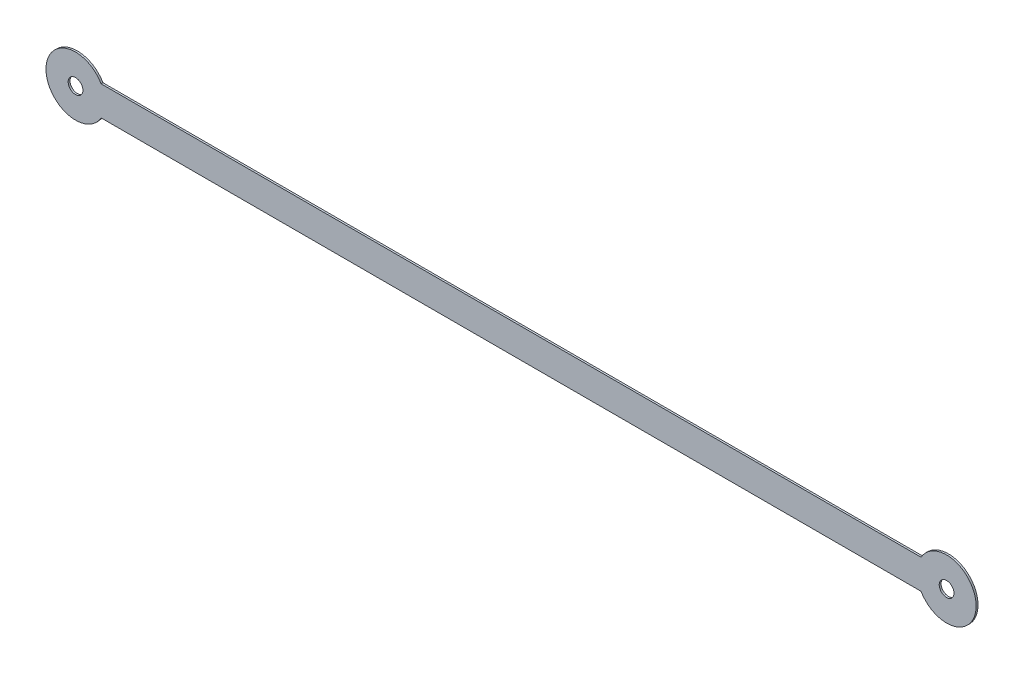
ISO-10303-21;
HEADER;
FILE_DESCRIPTION(('STEP AP214'),'2;1');
FILE_NAME('part.step','',(''),(''),'','','');
FILE_SCHEMA(('AUTOMOTIVE_DESIGN { 1 0 10303 214 1 1 1 1 }'));
ENDSEC;
DATA;
#1=APPLICATION_CONTEXT('core data for automotive mechanical design processes');
#2=APPLICATION_PROTOCOL_DEFINITION('international standard','automotive_design',2000,#1);
#3=PRODUCT_CONTEXT('',#1,'mechanical');
#4=PRODUCT('Part','Part','',(#3));
#5=PRODUCT_RELATED_PRODUCT_CATEGORY('part','',(#4));
#6=PRODUCT_DEFINITION_FORMATION('','',#4);
#7=PRODUCT_DEFINITION_CONTEXT('part definition',#1,'design');
#8=PRODUCT_DEFINITION('design','',#6,#7);
#9=PRODUCT_DEFINITION_SHAPE('','',#8);
#10=(LENGTH_UNIT() NAMED_UNIT(*) SI_UNIT(.MILLI.,.METRE.));
#11=(NAMED_UNIT(*) PLANE_ANGLE_UNIT() SI_UNIT($,.RADIAN.));
#12=(NAMED_UNIT(*) SI_UNIT($,.STERADIAN.) SOLID_ANGLE_UNIT());
#13=UNCERTAINTY_MEASURE_WITH_UNIT(LENGTH_MEASURE(1.E-05),#10,'distance_accuracy_value','');
#14=(GEOMETRIC_REPRESENTATION_CONTEXT(3) GLOBAL_UNCERTAINTY_ASSIGNED_CONTEXT((#13)) GLOBAL_UNIT_ASSIGNED_CONTEXT((#10,
#11,#12)) REPRESENTATION_CONTEXT('',''));
#15=CARTESIAN_POINT('',(0.,0.,0.));
#16=DIRECTION('',(0.,0.,1.));
#17=DIRECTION('',(1.,0.,0.));
#18=AXIS2_PLACEMENT_3D('',#15,#16,#17);
#19=CARTESIAN_POINT('',(0.,0.,0.254));
#20=DIRECTION('',(0.,0.,1.));
#21=DIRECTION('',(1.,0.,0.));
#22=AXIS2_PLACEMENT_3D('',#19,#20,#21);
#23=PLANE('',#22);
#24=DIRECTION('',(1.,0.,0.));
#25=VECTOR('',#24,1.);
#26=CARTESIAN_POINT('',(114.535898384862,-2.,0.254));
#27=LINE('',#26,#25);
#28=CARTESIAN_POINT('',(3.46410161513775,-2.,0.254));
#29=VERTEX_POINT('',#28);
#30=CARTESIAN_POINT('',(114.535898384862,-2.,0.254));
#31=VERTEX_POINT('',#30);
#32=EDGE_CURVE('E91',#29,#31,#27,.T.);
#33=ORIENTED_EDGE('',*,*,#32,.T.);
#34=CARTESIAN_POINT('',(118.,0.,0.254));
#35=DIRECTION('',(0.,0.,1.));
#36=DIRECTION('',(1.,0.,0.));
#37=AXIS2_PLACEMENT_3D('',#34,#35,#36);
#38=CIRCLE('',#37,4.);
#39=CARTESIAN_POINT('',(114.535898384862,2.,0.254));
#40=VERTEX_POINT('',#39);
#41=EDGE_CURVE('E11',#31,#40,#38,.T.);
#42=ORIENTED_EDGE('',*,*,#41,.T.);
#43=DIRECTION('',(-1.,0.,0.));
#44=VECTOR('',#43,1.);
#45=CARTESIAN_POINT('',(114.535898384862,2.,0.254));
#46=LINE('',#45,#44);
#47=CARTESIAN_POINT('',(3.46410161513775,2.,0.254));
#48=VERTEX_POINT('',#47);
#49=EDGE_CURVE('E96',#40,#48,#46,.T.);
#50=ORIENTED_EDGE('',*,*,#49,.T.);
#51=CARTESIAN_POINT('',(0.,0.,0.254));
#52=DIRECTION('',(0.,0.,1.));
#53=DIRECTION('',(1.,0.,0.));
#54=AXIS2_PLACEMENT_3D('',#51,#52,#53);
#55=CIRCLE('',#54,4.);
#56=EDGE_CURVE('E42',#48,#29,#55,.T.);
#57=ORIENTED_EDGE('',*,*,#56,.T.);
#58=EDGE_LOOP('',(#33,#42,#50,#57));
#59=FACE_BOUND('',#58,.T.);
#60=CARTESIAN_POINT('',(0.,0.,0.254));
#61=DIRECTION('',(0.,0.,1.));
#62=DIRECTION('',(1.,0.,0.));
#63=AXIS2_PLACEMENT_3D('',#60,#61,#62);
#64=CIRCLE('',#63,1.);
#65=CARTESIAN_POINT('',(1.,0.,0.254));
#66=VERTEX_POINT('',#65);
#67=EDGE_CURVE('E111',#66,#66,#64,.T.);
#68=ORIENTED_EDGE('',*,*,#67,.F.);
#69=EDGE_LOOP('',(#68));
#70=FACE_BOUND('',#69,.T.);
#71=CARTESIAN_POINT('',(118.,0.,0.254));
#72=DIRECTION('',(0.,0.,1.));
#73=DIRECTION('',(1.,0.,0.));
#74=AXIS2_PLACEMENT_3D('',#71,#72,#73);
#75=CIRCLE('',#74,1.00000000000009);
#76=CARTESIAN_POINT('',(119.,0.,0.254));
#77=VERTEX_POINT('',#76);
#78=EDGE_CURVE('E105',#77,#77,#75,.T.);
#79=ORIENTED_EDGE('',*,*,#78,.F.);
#80=EDGE_LOOP('',(#79));
#81=FACE_BOUND('',#80,.T.);
#82=ADVANCED_FACE('F32',(#59,#70,#81),#23,.T.);
#83=CARTESIAN_POINT('',(0.,0.,0.));
#84=DIRECTION('',(0.,0.,1.));
#85=DIRECTION('',(1.,0.,0.));
#86=AXIS2_PLACEMENT_3D('',#83,#84,#85);
#87=PLANE('',#86);
#88=CARTESIAN_POINT('',(118.,0.,0.));
#89=DIRECTION('',(0.,0.,1.));
#90=DIRECTION('',(1.,0.,0.));
#91=AXIS2_PLACEMENT_3D('',#88,#89,#90);
#92=CIRCLE('',#91,4.);
#93=CARTESIAN_POINT('',(114.535898384862,-2.,0.));
#94=VERTEX_POINT('',#93);
#95=CARTESIAN_POINT('',(114.535898384862,2.,0.));
#96=VERTEX_POINT('',#95);
#97=EDGE_CURVE('E36',#94,#96,#92,.T.);
#98=ORIENTED_EDGE('',*,*,#97,.F.);
#99=DIRECTION('',(1.,0.,0.));
#100=VECTOR('',#99,1.);
#101=CARTESIAN_POINT('',(114.535898384862,-2.,0.));
#102=LINE('',#101,#100);
#103=CARTESIAN_POINT('',(3.46410161513775,-2.,0.));
#104=VERTEX_POINT('',#103);
#105=EDGE_CURVE('E78',#104,#94,#102,.T.);
#106=ORIENTED_EDGE('',*,*,#105,.F.);
#107=CARTESIAN_POINT('',(0.,0.,0.));
#108=DIRECTION('',(0.,0.,1.));
#109=DIRECTION('',(1.,0.,0.));
#110=AXIS2_PLACEMENT_3D('',#107,#108,#109);
#111=CIRCLE('',#110,4.);
#112=CARTESIAN_POINT('',(3.46410161513775,2.,0.));
#113=VERTEX_POINT('',#112);
#114=EDGE_CURVE('E81',#113,#104,#111,.T.);
#115=ORIENTED_EDGE('',*,*,#114,.F.);
#116=DIRECTION('',(-1.,0.,0.));
#117=VECTOR('',#116,1.);
#118=CARTESIAN_POINT('',(114.535898384862,2.,0.));
#119=LINE('',#118,#117);
#120=EDGE_CURVE('E80',#96,#113,#119,.T.);
#121=ORIENTED_EDGE('',*,*,#120,.F.);
#122=EDGE_LOOP('',(#98,#106,#115,#121));
#123=FACE_BOUND('',#122,.T.);
#124=CARTESIAN_POINT('',(0.,0.,0.));
#125=DIRECTION('',(0.,0.,1.));
#126=DIRECTION('',(1.,0.,0.));
#127=AXIS2_PLACEMENT_3D('',#124,#125,#126);
#128=CIRCLE('',#127,1.);
#129=CARTESIAN_POINT('',(1.,0.,0.));
#130=VERTEX_POINT('',#129);
#131=EDGE_CURVE('E108',#130,#130,#128,.T.);
#132=ORIENTED_EDGE('',*,*,#131,.T.);
#133=EDGE_LOOP('',(#132));
#134=FACE_BOUND('',#133,.T.);
#135=CARTESIAN_POINT('',(118.,0.,0.));
#136=DIRECTION('',(0.,0.,1.));
#137=DIRECTION('',(1.,0.,0.));
#138=AXIS2_PLACEMENT_3D('',#135,#136,#137);
#139=CIRCLE('',#138,1.00000000000009);
#140=CARTESIAN_POINT('',(119.,0.,0.));
#141=VERTEX_POINT('',#140);
#142=EDGE_CURVE('E103',#141,#141,#139,.T.);
#143=ORIENTED_EDGE('',*,*,#142,.T.);
#144=EDGE_LOOP('',(#143));
#145=FACE_BOUND('',#144,.T.);
#146=ADVANCED_FACE('F75',(#123,#134,#145),#87,.F.);
#147=CARTESIAN_POINT('',(0.,0.,0.254));
#148=DIRECTION('',(0.,0.,-1.));
#149=DIRECTION('',(-1.,0.,0.));
#150=AXIS2_PLACEMENT_3D('',#147,#148,#149);
#151=CYLINDRICAL_SURFACE('',#150,4.);
#152=ORIENTED_EDGE('',*,*,#114,.T.);
#153=DIRECTION('',(0.,0.,-1.));
#154=VECTOR('',#153,1.);
#155=CARTESIAN_POINT('',(3.46410161513775,-2.,0.254));
#156=LINE('',#155,#154);
#157=EDGE_CURVE('E87',#29,#104,#156,.T.);
#158=ORIENTED_EDGE('',*,*,#157,.F.);
#159=ORIENTED_EDGE('',*,*,#56,.F.);
#160=DIRECTION('',(0.,0.,-1.));
#161=VECTOR('',#160,1.);
#162=CARTESIAN_POINT('',(3.46410161513775,2.,0.254));
#163=LINE('',#162,#161);
#164=EDGE_CURVE('E101',#48,#113,#163,.T.);
#165=ORIENTED_EDGE('',*,*,#164,.T.);
#166=EDGE_LOOP('',(#152,#158,#159,#165));
#167=FACE_BOUND('',#166,.T.);
#168=ADVANCED_FACE('F34',(#167),#151,.T.);
#169=CARTESIAN_POINT('',(118.,0.,0.254));
#170=DIRECTION('',(0.,0.,-1.));
#171=DIRECTION('',(-1.,0.,0.));
#172=AXIS2_PLACEMENT_3D('',#169,#170,#171);
#173=CYLINDRICAL_SURFACE('',#172,4.);
#174=ORIENTED_EDGE('',*,*,#97,.T.);
#175=DIRECTION('',(0.,0.,-1.));
#176=VECTOR('',#175,1.);
#177=CARTESIAN_POINT('',(114.535898384862,2.,0.254));
#178=LINE('',#177,#176);
#179=EDGE_CURVE('E99',#40,#96,#178,.T.);
#180=ORIENTED_EDGE('',*,*,#179,.F.);
#181=ORIENTED_EDGE('',*,*,#41,.F.);
#182=DIRECTION('',(0.,0.,-1.));
#183=VECTOR('',#182,1.);
#184=CARTESIAN_POINT('',(114.535898384862,-2.,0.254));
#185=LINE('',#184,#183);
#186=EDGE_CURVE('E82',#31,#94,#185,.T.);
#187=ORIENTED_EDGE('',*,*,#186,.T.);
#188=EDGE_LOOP('',(#174,#180,#181,#187));
#189=FACE_BOUND('',#188,.T.);
#190=ADVANCED_FACE('F83',(#189),#173,.T.);
#191=CARTESIAN_POINT('',(0.,0.,0.254));
#192=DIRECTION('',(0.,0.,-1.));
#193=DIRECTION('',(-1.,0.,0.));
#194=AXIS2_PLACEMENT_3D('',#191,#192,#193);
#195=CYLINDRICAL_SURFACE('',#194,1.);
#196=ORIENTED_EDGE('',*,*,#67,.T.);
#197=EDGE_LOOP('',(#196));
#198=FACE_BOUND('',#197,.T.);
#199=ORIENTED_EDGE('',*,*,#131,.F.);
#200=EDGE_LOOP('',(#199));
#201=FACE_BOUND('',#200,.T.);
#202=ADVANCED_FACE('F130',(#198,#201),#195,.F.);
#203=CARTESIAN_POINT('',(118.,0.,0.254));
#204=DIRECTION('',(0.,0.,-1.));
#205=DIRECTION('',(-1.,0.,0.));
#206=AXIS2_PLACEMENT_3D('',#203,#204,#205);
#207=CYLINDRICAL_SURFACE('',#206,1.00000000000009);
#208=ORIENTED_EDGE('',*,*,#78,.T.);
#209=EDGE_LOOP('',(#208));
#210=FACE_BOUND('',#209,.T.);
#211=ORIENTED_EDGE('',*,*,#142,.F.);
#212=EDGE_LOOP('',(#211));
#213=FACE_BOUND('',#212,.T.);
#214=ADVANCED_FACE('F127',(#210,#213),#207,.F.);
#215=CARTESIAN_POINT('',(114.535898384862,2.,0.254));
#216=DIRECTION('',(0.,-1.,0.));
#217=DIRECTION('',(0.,0.,-1.));
#218=AXIS2_PLACEMENT_3D('',#215,#216,#217);
#219=PLANE('',#218);
#220=ORIENTED_EDGE('',*,*,#120,.T.);
#221=ORIENTED_EDGE('',*,*,#164,.F.);
#222=ORIENTED_EDGE('',*,*,#49,.F.);
#223=ORIENTED_EDGE('',*,*,#179,.T.);
#224=EDGE_LOOP('',(#220,#221,#222,#223));
#225=FACE_BOUND('',#224,.T.);
#226=ADVANCED_FACE('F118',(#225),#219,.F.);
#227=CARTESIAN_POINT('',(114.535898384862,-2.,0.254));
#228=DIRECTION('',(0.,1.,0.));
#229=DIRECTION('',(0.,0.,1.));
#230=AXIS2_PLACEMENT_3D('',#227,#228,#229);
#231=PLANE('',#230);
#232=ORIENTED_EDGE('',*,*,#105,.T.);
#233=ORIENTED_EDGE('',*,*,#186,.F.);
#234=ORIENTED_EDGE('',*,*,#32,.F.);
#235=ORIENTED_EDGE('',*,*,#157,.T.);
#236=EDGE_LOOP('',(#232,#233,#234,#235));
#237=FACE_BOUND('',#236,.T.);
#238=ADVANCED_FACE('F90',(#237),#231,.F.);
#239=CLOSED_SHELL('',(#82,#146,#168,#190,#202,#214,#226,#238));
#240=MANIFOLD_SOLID_BREP('B2',#239);
#241=ADVANCED_BREP_SHAPE_REPRESENTATION('',(#18,#240),#14);
#242=SHAPE_DEFINITION_REPRESENTATION(#9,#241);
ENDSEC;
END-ISO-10303-21;
